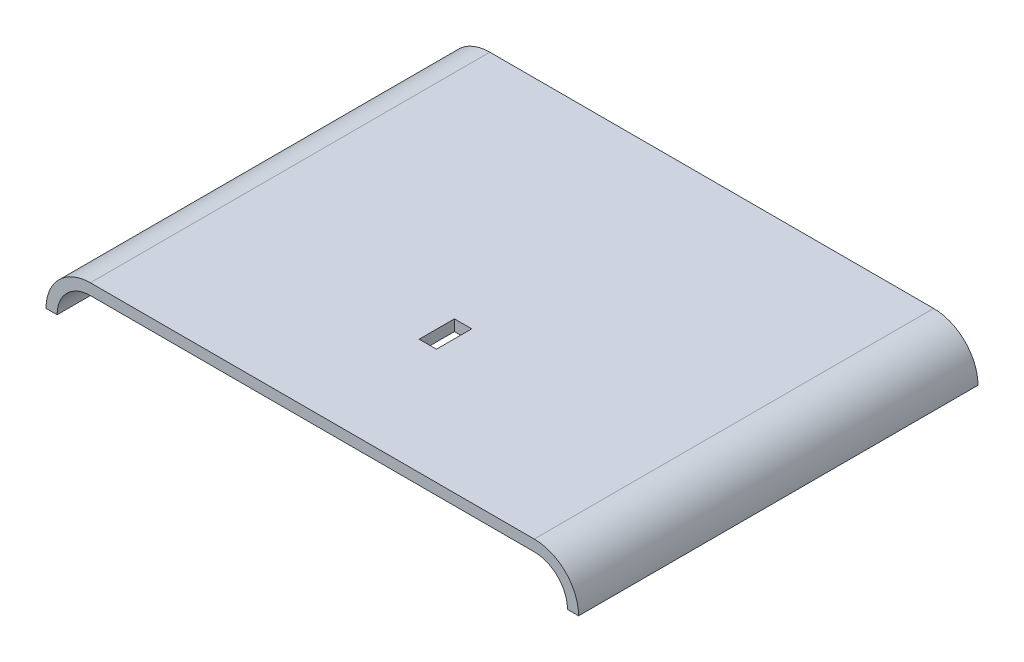
ISO-10303-21;
HEADER;
FILE_DESCRIPTION(('STEP AP214'),'2;1');
FILE_NAME('part.step','',(''),(''),'','','');
FILE_SCHEMA(('AUTOMOTIVE_DESIGN { 1 0 10303 214 1 1 1 1 }'));
ENDSEC;
DATA;
#1=APPLICATION_CONTEXT('core data for automotive mechanical design processes');
#2=APPLICATION_PROTOCOL_DEFINITION('international standard','automotive_design',2000,#1);
#3=PRODUCT_CONTEXT('',#1,'mechanical');
#4=PRODUCT('Part','Part','',(#3));
#5=PRODUCT_RELATED_PRODUCT_CATEGORY('part','',(#4));
#6=PRODUCT_DEFINITION_FORMATION('','',#4);
#7=PRODUCT_DEFINITION_CONTEXT('part definition',#1,'design');
#8=PRODUCT_DEFINITION('design','',#6,#7);
#9=PRODUCT_DEFINITION_SHAPE('','',#8);
#10=(LENGTH_UNIT() NAMED_UNIT(*) SI_UNIT(.MILLI.,.METRE.));
#11=(NAMED_UNIT(*) PLANE_ANGLE_UNIT() SI_UNIT($,.RADIAN.));
#12=(NAMED_UNIT(*) SI_UNIT($,.STERADIAN.) SOLID_ANGLE_UNIT());
#13=UNCERTAINTY_MEASURE_WITH_UNIT(LENGTH_MEASURE(1.E-05),#10,'distance_accuracy_value','');
#14=(GEOMETRIC_REPRESENTATION_CONTEXT(3) GLOBAL_UNCERTAINTY_ASSIGNED_CONTEXT((#13)) GLOBAL_UNIT_ASSIGNED_CONTEXT((#10,
#11,#12)) REPRESENTATION_CONTEXT('',''));
#15=CARTESIAN_POINT('',(0.,0.,0.));
#16=DIRECTION('',(0.,0.,1.));
#17=DIRECTION('',(1.,0.,0.));
#18=AXIS2_PLACEMENT_3D('',#15,#16,#17);
#19=CARTESIAN_POINT('',(254.,-50.8,457.2));
#20=DIRECTION('',(0.,0.,-1.));
#21=DIRECTION('',(-1.,0.,0.));
#22=AXIS2_PLACEMENT_3D('',#19,#20,#21);
#23=CYLINDRICAL_SURFACE('',#22,38.1);
#24=CARTESIAN_POINT('',(254.,-50.8,0.));
#25=DIRECTION('',(0.,0.,1.));
#26=DIRECTION('',(1.,0.,0.));
#27=AXIS2_PLACEMENT_3D('',#24,#25,#26);
#28=CIRCLE('',#27,38.1);
#29=CARTESIAN_POINT('',(254.,-12.7,0.));
#30=VERTEX_POINT('',#29);
#31=CARTESIAN_POINT('',(292.1,-50.8,0.));
#32=VERTEX_POINT('',#31);
#33=EDGE_CURVE('E194',#30,#32,#28,.F.);
#34=ORIENTED_EDGE('',*,*,#33,.T.);
#35=DIRECTION('',(0.,0.,-1.));
#36=VECTOR('',#35,1.);
#37=CARTESIAN_POINT('',(292.1,-50.8,457.2));
#38=LINE('',#37,#36);
#39=CARTESIAN_POINT('',(292.1,-50.8,457.2));
#40=VERTEX_POINT('',#39);
#41=EDGE_CURVE('E228',#40,#32,#38,.T.);
#42=ORIENTED_EDGE('',*,*,#41,.F.);
#43=CARTESIAN_POINT('',(254.,-50.8,457.2));
#44=DIRECTION('',(0.,0.,1.));
#45=DIRECTION('',(1.,0.,0.));
#46=AXIS2_PLACEMENT_3D('',#43,#44,#45);
#47=CIRCLE('',#46,38.1);
#48=CARTESIAN_POINT('',(254.,-12.7,457.2));
#49=VERTEX_POINT('',#48);
#50=EDGE_CURVE('E195',#49,#40,#47,.F.);
#51=ORIENTED_EDGE('',*,*,#50,.F.);
#52=DIRECTION('',(0.,0.,-1.));
#53=VECTOR('',#52,1.);
#54=CARTESIAN_POINT('',(254.,-12.7,457.2));
#55=LINE('',#54,#53);
#56=EDGE_CURVE('E209',#49,#30,#55,.T.);
#57=ORIENTED_EDGE('',*,*,#56,.T.);
#58=EDGE_LOOP('',(#34,#42,#51,#57));
#59=FACE_BOUND('',#58,.T.);
#60=ADVANCED_FACE('F43',(#59),#23,.F.);
#61=CARTESIAN_POINT('',(304.8,-50.8,457.2));
#62=DIRECTION('',(0.,-1.,0.));
#63=DIRECTION('',(0.,0.,-1.));
#64=AXIS2_PLACEMENT_3D('',#61,#62,#63);
#65=PLANE('',#64);
#66=DIRECTION('',(-1.,0.,0.));
#67=VECTOR('',#66,1.);
#68=CARTESIAN_POINT('',(304.8,-50.8,0.));
#69=LINE('',#68,#67);
#70=CARTESIAN_POINT('',(304.8,-50.8,0.));
#71=VERTEX_POINT('',#70);
#72=EDGE_CURVE('E212',#71,#32,#69,.T.);
#73=ORIENTED_EDGE('',*,*,#72,.F.);
#74=DIRECTION('',(0.,0.,-1.));
#75=VECTOR('',#74,1.);
#76=CARTESIAN_POINT('',(304.8,-50.8,457.2));
#77=LINE('',#76,#75);
#78=CARTESIAN_POINT('',(304.8,-50.8,457.2));
#79=VERTEX_POINT('',#78);
#80=EDGE_CURVE('E226',#79,#71,#77,.T.);
#81=ORIENTED_EDGE('',*,*,#80,.F.);
#82=DIRECTION('',(-1.,0.,0.));
#83=VECTOR('',#82,1.);
#84=CARTESIAN_POINT('',(304.8,-50.8,457.2));
#85=LINE('',#84,#83);
#86=EDGE_CURVE('E197',#79,#40,#85,.T.);
#87=ORIENTED_EDGE('',*,*,#86,.T.);
#88=ORIENTED_EDGE('',*,*,#41,.T.);
#89=EDGE_LOOP('',(#73,#81,#87,#88));
#90=FACE_BOUND('',#89,.T.);
#91=ADVANCED_FACE('F255',(#90),#65,.T.);
#92=CARTESIAN_POINT('',(254.,-50.8,457.2));
#93=DIRECTION('',(0.,0.,-1.));
#94=DIRECTION('',(-1.,0.,0.));
#95=AXIS2_PLACEMENT_3D('',#92,#93,#94);
#96=CYLINDRICAL_SURFACE('',#95,50.8);
#97=CARTESIAN_POINT('',(254.,-50.8,0.));
#98=DIRECTION('',(0.,0.,-1.));
#99=DIRECTION('',(-1.,0.,0.));
#100=AXIS2_PLACEMENT_3D('',#97,#98,#99);
#101=CIRCLE('',#100,50.8);
#102=CARTESIAN_POINT('',(254.,0.,0.));
#103=VERTEX_POINT('',#102);
#104=EDGE_CURVE('E215',#103,#71,#101,.T.);
#105=ORIENTED_EDGE('',*,*,#104,.F.);
#106=DIRECTION('',(0.,0.,-1.));
#107=VECTOR('',#106,1.);
#108=CARTESIAN_POINT('',(254.,0.,457.2));
#109=LINE('',#108,#107);
#110=CARTESIAN_POINT('',(254.,0.,457.2));
#111=VERTEX_POINT('',#110);
#112=EDGE_CURVE('E224',#111,#103,#109,.T.);
#113=ORIENTED_EDGE('',*,*,#112,.F.);
#114=CARTESIAN_POINT('',(254.,-50.8,457.2));
#115=DIRECTION('',(0.,0.,-1.));
#116=DIRECTION('',(-1.,0.,0.));
#117=AXIS2_PLACEMENT_3D('',#114,#115,#116);
#118=CIRCLE('',#117,50.8);
#119=EDGE_CURVE('E201',#111,#79,#118,.T.);
#120=ORIENTED_EDGE('',*,*,#119,.T.);
#121=ORIENTED_EDGE('',*,*,#80,.T.);
#122=EDGE_LOOP('',(#105,#113,#120,#121));
#123=FACE_BOUND('',#122,.T.);
#124=ADVANCED_FACE('F260',(#123),#96,.T.);
#125=CARTESIAN_POINT('',(0.,0.,457.2));
#126=DIRECTION('',(0.,1.,0.));
#127=DIRECTION('',(0.,0.,1.));
#128=AXIS2_PLACEMENT_3D('',#125,#126,#127);
#129=PLANE('',#128);
#130=DIRECTION('',(0.,0.,1.));
#131=VECTOR('',#130,1.);
#132=CARTESIAN_POINT('',(-9.90599999999999,0.,284.607));
#133=LINE('',#132,#131);
#134=CARTESIAN_POINT('',(-9.90599999999999,0.,284.607));
#135=VERTEX_POINT('',#134);
#136=CARTESIAN_POINT('',(-9.90599999999999,0.,324.993));
#137=VERTEX_POINT('',#136);
#138=EDGE_CURVE('E60',#135,#137,#133,.T.);
#139=ORIENTED_EDGE('',*,*,#138,.F.);
#140=DIRECTION('',(-1.,0.,0.));
#141=VECTOR('',#140,1.);
#142=CARTESIAN_POINT('',(9.90600000000001,0.,284.607));
#143=LINE('',#142,#141);
#144=CARTESIAN_POINT('',(9.90600000000001,0.,284.607));
#145=VERTEX_POINT('',#144);
#146=EDGE_CURVE('E157',#145,#135,#143,.T.);
#147=ORIENTED_EDGE('',*,*,#146,.F.);
#148=DIRECTION('',(0.,0.,-1.));
#149=VECTOR('',#148,1.);
#150=CARTESIAN_POINT('',(9.90600000000001,0.,284.607));
#151=LINE('',#150,#149);
#152=CARTESIAN_POINT('',(9.90600000000001,0.,324.993));
#153=VERTEX_POINT('',#152);
#154=EDGE_CURVE('E139',#153,#145,#151,.T.);
#155=ORIENTED_EDGE('',*,*,#154,.F.);
#156=DIRECTION('',(1.,0.,0.));
#157=VECTOR('',#156,1.);
#158=CARTESIAN_POINT('',(9.90600000000001,0.,324.993));
#159=LINE('',#158,#157);
#160=EDGE_CURVE('E149',#137,#153,#159,.T.);
#161=ORIENTED_EDGE('',*,*,#160,.F.);
#162=EDGE_LOOP('',(#139,#147,#155,#161));
#163=FACE_BOUND('',#162,.T.);
#164=DIRECTION('',(1.,0.,0.));
#165=VECTOR('',#164,1.);
#166=CARTESIAN_POINT('',(0.,0.,0.));
#167=LINE('',#166,#165);
#168=CARTESIAN_POINT('',(-254.,0.,0.));
#169=VERTEX_POINT('',#168);
#170=EDGE_CURVE('E218',#169,#103,#167,.T.);
#171=ORIENTED_EDGE('',*,*,#170,.F.);
#172=DIRECTION('',(0.,0.,-1.));
#173=VECTOR('',#172,1.);
#174=CARTESIAN_POINT('',(-254.,0.,457.2));
#175=LINE('',#174,#173);
#176=CARTESIAN_POINT('',(-254.,0.,457.2));
#177=VERTEX_POINT('',#176);
#178=EDGE_CURVE('E188',#177,#169,#175,.T.);
#179=ORIENTED_EDGE('',*,*,#178,.F.);
#180=DIRECTION('',(1.,0.,0.));
#181=VECTOR('',#180,1.);
#182=CARTESIAN_POINT('',(0.,0.,457.2));
#183=LINE('',#182,#181);
#184=EDGE_CURVE('E204',#177,#111,#183,.T.);
#185=ORIENTED_EDGE('',*,*,#184,.T.);
#186=ORIENTED_EDGE('',*,*,#112,.T.);
#187=EDGE_LOOP('',(#171,#179,#185,#186));
#188=FACE_BOUND('',#187,.T.);
#189=ADVANCED_FACE('F154',(#163,#188),#129,.T.);
#190=CARTESIAN_POINT('',(0.,-12.7,457.2));
#191=DIRECTION('',(0.,1.,0.));
#192=DIRECTION('',(0.,0.,1.));
#193=AXIS2_PLACEMENT_3D('',#190,#191,#192);
#194=PLANE('',#193);
#195=DIRECTION('',(-1.,0.,0.));
#196=VECTOR('',#195,1.);
#197=CARTESIAN_POINT('',(0.,-12.7,284.607));
#198=LINE('',#197,#196);
#199=CARTESIAN_POINT('',(9.90600000000001,-12.7,284.607));
#200=VERTEX_POINT('',#199);
#201=CARTESIAN_POINT('',(-9.90599999999999,-12.7,284.607));
#202=VERTEX_POINT('',#201);
#203=EDGE_CURVE('E51',#200,#202,#198,.T.);
#204=ORIENTED_EDGE('',*,*,#203,.T.);
#205=DIRECTION('',(0.,0.,1.));
#206=VECTOR('',#205,1.);
#207=CARTESIAN_POINT('',(-9.90599999999997,-12.7,457.2));
#208=LINE('',#207,#206);
#209=CARTESIAN_POINT('',(-9.90599999999999,-12.7,324.993));
#210=VERTEX_POINT('',#209);
#211=EDGE_CURVE('E11',#202,#210,#208,.T.);
#212=ORIENTED_EDGE('',*,*,#211,.T.);
#213=DIRECTION('',(1.,0.,0.));
#214=VECTOR('',#213,1.);
#215=CARTESIAN_POINT('',(0.,-12.7,324.993));
#216=LINE('',#215,#214);
#217=CARTESIAN_POINT('',(9.90600000000001,-12.7,324.993));
#218=VERTEX_POINT('',#217);
#219=EDGE_CURVE('E230',#210,#218,#216,.T.);
#220=ORIENTED_EDGE('',*,*,#219,.T.);
#221=DIRECTION('',(0.,0.,-1.));
#222=VECTOR('',#221,1.);
#223=CARTESIAN_POINT('',(9.90600000000003,-12.7,457.2));
#224=LINE('',#223,#222);
#225=EDGE_CURVE('E142',#218,#200,#224,.T.);
#226=ORIENTED_EDGE('',*,*,#225,.T.);
#227=EDGE_LOOP('',(#204,#212,#220,#226));
#228=FACE_BOUND('',#227,.T.);
#229=DIRECTION('',(1.,0.,0.));
#230=VECTOR('',#229,1.);
#231=CARTESIAN_POINT('',(0.,-12.7,0.));
#232=LINE('',#231,#230);
#233=CARTESIAN_POINT('',(-254.,-12.7,0.));
#234=VERTEX_POINT('',#233);
#235=EDGE_CURVE('E198',#234,#30,#232,.T.);
#236=ORIENTED_EDGE('',*,*,#235,.T.);
#237=ORIENTED_EDGE('',*,*,#56,.F.);
#238=DIRECTION('',(1.,0.,0.));
#239=VECTOR('',#238,1.);
#240=CARTESIAN_POINT('',(0.,-12.7,457.2));
#241=LINE('',#240,#239);
#242=CARTESIAN_POINT('',(-254.,-12.7,457.2));
#243=VERTEX_POINT('',#242);
#244=EDGE_CURVE('E207',#243,#49,#241,.T.);
#245=ORIENTED_EDGE('',*,*,#244,.F.);
#246=DIRECTION('',(0.,0.,-1.));
#247=VECTOR('',#246,1.);
#248=CARTESIAN_POINT('',(-254.,-12.7,457.2));
#249=LINE('',#248,#247);
#250=EDGE_CURVE('E191',#243,#234,#249,.T.);
#251=ORIENTED_EDGE('',*,*,#250,.T.);
#252=EDGE_LOOP('',(#236,#237,#245,#251));
#253=FACE_BOUND('',#252,.T.);
#254=ADVANCED_FACE('F236',(#228,#253),#194,.F.);
#255=CARTESIAN_POINT('',(254.,-50.8,457.2));
#256=DIRECTION('',(0.,0.,1.));
#257=DIRECTION('',(1.,0.,0.));
#258=AXIS2_PLACEMENT_3D('',#255,#256,#257);
#259=PLANE('',#258);
#260=ORIENTED_EDGE('',*,*,#50,.T.);
#261=ORIENTED_EDGE('',*,*,#86,.F.);
#262=ORIENTED_EDGE('',*,*,#119,.F.);
#263=ORIENTED_EDGE('',*,*,#184,.F.);
#264=CARTESIAN_POINT('',(-254.,-50.8,457.2));
#265=DIRECTION('',(0.,0.,1.));
#266=DIRECTION('',(1.,0.,0.));
#267=AXIS2_PLACEMENT_3D('',#264,#265,#266);
#268=CIRCLE('',#267,50.8);
#269=CARTESIAN_POINT('',(-304.8,-50.8,457.2));
#270=VERTEX_POINT('',#269);
#271=EDGE_CURVE('E172',#177,#270,#268,.T.);
#272=ORIENTED_EDGE('',*,*,#271,.T.);
#273=DIRECTION('',(1.,0.,0.));
#274=VECTOR('',#273,1.);
#275=CARTESIAN_POINT('',(-304.8,-50.8,457.2));
#276=LINE('',#275,#274);
#277=CARTESIAN_POINT('',(-292.1,-50.8,457.2));
#278=VERTEX_POINT('',#277);
#279=EDGE_CURVE('E175',#270,#278,#276,.T.);
#280=ORIENTED_EDGE('',*,*,#279,.T.);
#281=CARTESIAN_POINT('',(-254.,-50.8,457.2));
#282=DIRECTION('',(0.,0.,-1.));
#283=DIRECTION('',(-1.,0.,0.));
#284=AXIS2_PLACEMENT_3D('',#281,#282,#283);
#285=CIRCLE('',#284,38.1);
#286=EDGE_CURVE('E169',#243,#278,#285,.F.);
#287=ORIENTED_EDGE('',*,*,#286,.F.);
#288=ORIENTED_EDGE('',*,*,#244,.T.);
#289=EDGE_LOOP('',(#260,#261,#262,#263,#272,#280,#287,#288));
#290=FACE_BOUND('',#289,.T.);
#291=ADVANCED_FACE('F273',(#290),#259,.T.);
#292=CARTESIAN_POINT('',(254.,-50.8,0.));
#293=DIRECTION('',(0.,0.,1.));
#294=DIRECTION('',(1.,0.,0.));
#295=AXIS2_PLACEMENT_3D('',#292,#293,#294);
#296=PLANE('',#295);
#297=ORIENTED_EDGE('',*,*,#33,.F.);
#298=ORIENTED_EDGE('',*,*,#235,.F.);
#299=CARTESIAN_POINT('',(-254.,-50.8,0.));
#300=DIRECTION('',(0.,0.,-1.));
#301=DIRECTION('',(-1.,0.,0.));
#302=AXIS2_PLACEMENT_3D('',#299,#300,#301);
#303=CIRCLE('',#302,38.1);
#304=CARTESIAN_POINT('',(-292.1,-50.8,0.));
#305=VERTEX_POINT('',#304);
#306=EDGE_CURVE('E165',#234,#305,#303,.F.);
#307=ORIENTED_EDGE('',*,*,#306,.T.);
#308=DIRECTION('',(1.,0.,0.));
#309=VECTOR('',#308,1.);
#310=CARTESIAN_POINT('',(-304.8,-50.8,0.));
#311=LINE('',#310,#309);
#312=CARTESIAN_POINT('',(-304.8,-50.8,0.));
#313=VERTEX_POINT('',#312);
#314=EDGE_CURVE('E173',#313,#305,#311,.T.);
#315=ORIENTED_EDGE('',*,*,#314,.F.);
#316=CARTESIAN_POINT('',(-254.,-50.8,0.));
#317=DIRECTION('',(0.,0.,1.));
#318=DIRECTION('',(1.,0.,0.));
#319=AXIS2_PLACEMENT_3D('',#316,#317,#318);
#320=CIRCLE('',#319,50.8);
#321=EDGE_CURVE('E180',#169,#313,#320,.T.);
#322=ORIENTED_EDGE('',*,*,#321,.F.);
#323=ORIENTED_EDGE('',*,*,#170,.T.);
#324=ORIENTED_EDGE('',*,*,#104,.T.);
#325=ORIENTED_EDGE('',*,*,#72,.T.);
#326=EDGE_LOOP('',(#297,#298,#307,#315,#322,#323,#324,#325));
#327=FACE_BOUND('',#326,.T.);
#328=ADVANCED_FACE('F268',(#327),#296,.F.);
#329=CARTESIAN_POINT('',(-254.,-50.8,457.2));
#330=DIRECTION('',(0.,0.,-1.));
#331=DIRECTION('',(-1.,0.,0.));
#332=AXIS2_PLACEMENT_3D('',#329,#330,#331);
#333=CYLINDRICAL_SURFACE('',#332,38.1);
#334=ORIENTED_EDGE('',*,*,#306,.F.);
#335=ORIENTED_EDGE('',*,*,#250,.F.);
#336=ORIENTED_EDGE('',*,*,#286,.T.);
#337=DIRECTION('',(0.,0.,-1.));
#338=VECTOR('',#337,1.);
#339=CARTESIAN_POINT('',(-292.1,-50.8,457.2));
#340=LINE('',#339,#338);
#341=EDGE_CURVE('E177',#278,#305,#340,.T.);
#342=ORIENTED_EDGE('',*,*,#341,.T.);
#343=EDGE_LOOP('',(#334,#335,#336,#342));
#344=FACE_BOUND('',#343,.T.);
#345=ADVANCED_FACE('F287',(#344),#333,.F.);
#346=CARTESIAN_POINT('',(-254.,-50.8,457.2));
#347=DIRECTION('',(0.,0.,-1.));
#348=DIRECTION('',(-1.,0.,0.));
#349=AXIS2_PLACEMENT_3D('',#346,#347,#348);
#350=CYLINDRICAL_SURFACE('',#349,50.8);
#351=ORIENTED_EDGE('',*,*,#321,.T.);
#352=DIRECTION('',(0.,0.,-1.));
#353=VECTOR('',#352,1.);
#354=CARTESIAN_POINT('',(-304.8,-50.8,457.2));
#355=LINE('',#354,#353);
#356=EDGE_CURVE('E185',#270,#313,#355,.T.);
#357=ORIENTED_EDGE('',*,*,#356,.F.);
#358=ORIENTED_EDGE('',*,*,#271,.F.);
#359=ORIENTED_EDGE('',*,*,#178,.T.);
#360=EDGE_LOOP('',(#351,#357,#358,#359));
#361=FACE_BOUND('',#360,.T.);
#362=ADVANCED_FACE('F250',(#361),#350,.T.);
#363=CARTESIAN_POINT('',(-304.8,-50.8,457.2));
#364=DIRECTION('',(0.,1.,0.));
#365=DIRECTION('',(0.,0.,1.));
#366=AXIS2_PLACEMENT_3D('',#363,#364,#365);
#367=PLANE('',#366);
#368=ORIENTED_EDGE('',*,*,#314,.T.);
#369=ORIENTED_EDGE('',*,*,#341,.F.);
#370=ORIENTED_EDGE('',*,*,#279,.F.);
#371=ORIENTED_EDGE('',*,*,#356,.T.);
#372=EDGE_LOOP('',(#368,#369,#370,#371));
#373=FACE_BOUND('',#372,.T.);
#374=ADVANCED_FACE('F243',(#373),#367,.F.);
#375=CARTESIAN_POINT('',(-9.90599999999999,-50.8,284.607));
#376=DIRECTION('',(-1.,0.,0.));
#377=DIRECTION('',(0.,0.,1.));
#378=AXIS2_PLACEMENT_3D('',#375,#376,#377);
#379=PLANE('',#378);
#380=DIRECTION('',(0.,1.,0.));
#381=VECTOR('',#380,1.);
#382=CARTESIAN_POINT('',(-9.90599999999999,-50.8,284.607));
#383=LINE('',#382,#381);
#384=EDGE_CURVE('E163',#202,#135,#383,.T.);
#385=ORIENTED_EDGE('',*,*,#384,.T.);
#386=ORIENTED_EDGE('',*,*,#138,.T.);
#387=DIRECTION('',(0.,1.,0.));
#388=VECTOR('',#387,1.);
#389=CARTESIAN_POINT('',(-9.90599999999999,-50.8,324.993));
#390=LINE('',#389,#388);
#391=EDGE_CURVE('E146',#210,#137,#390,.T.);
#392=ORIENTED_EDGE('',*,*,#391,.F.);
#393=ORIENTED_EDGE('',*,*,#211,.F.);
#394=EDGE_LOOP('',(#385,#386,#392,#393));
#395=FACE_BOUND('',#394,.T.);
#396=ADVANCED_FACE('F241',(#395),#379,.F.);
#397=CARTESIAN_POINT('',(9.90600000000001,-50.8,284.607));
#398=DIRECTION('',(0.,0.,-1.));
#399=DIRECTION('',(-1.,0.,0.));
#400=AXIS2_PLACEMENT_3D('',#397,#398,#399);
#401=PLANE('',#400);
#402=DIRECTION('',(0.,1.,0.));
#403=VECTOR('',#402,1.);
#404=CARTESIAN_POINT('',(9.90600000000001,-50.8,284.607));
#405=LINE('',#404,#403);
#406=EDGE_CURVE('E145',#200,#145,#405,.T.);
#407=ORIENTED_EDGE('',*,*,#406,.T.);
#408=ORIENTED_EDGE('',*,*,#146,.T.);
#409=ORIENTED_EDGE('',*,*,#384,.F.);
#410=ORIENTED_EDGE('',*,*,#203,.F.);
#411=EDGE_LOOP('',(#407,#408,#409,#410));
#412=FACE_BOUND('',#411,.T.);
#413=ADVANCED_FACE('F240',(#412),#401,.F.);
#414=CARTESIAN_POINT('',(9.90600000000001,-50.8,284.607));
#415=DIRECTION('',(1.,0.,0.));
#416=DIRECTION('',(0.,0.,-1.));
#417=AXIS2_PLACEMENT_3D('',#414,#415,#416);
#418=PLANE('',#417);
#419=DIRECTION('',(0.,1.,0.));
#420=VECTOR('',#419,1.);
#421=CARTESIAN_POINT('',(9.90600000000001,-50.8,324.993));
#422=LINE('',#421,#420);
#423=EDGE_CURVE('E70',#218,#153,#422,.T.);
#424=ORIENTED_EDGE('',*,*,#423,.T.);
#425=ORIENTED_EDGE('',*,*,#154,.T.);
#426=ORIENTED_EDGE('',*,*,#406,.F.);
#427=ORIENTED_EDGE('',*,*,#225,.F.);
#428=EDGE_LOOP('',(#424,#425,#426,#427));
#429=FACE_BOUND('',#428,.T.);
#430=ADVANCED_FACE('F136',(#429),#418,.F.);
#431=CARTESIAN_POINT('',(9.90600000000001,-50.8,324.993));
#432=DIRECTION('',(0.,0.,1.));
#433=DIRECTION('',(1.,0.,0.));
#434=AXIS2_PLACEMENT_3D('',#431,#432,#433);
#435=PLANE('',#434);
#436=ORIENTED_EDGE('',*,*,#391,.T.);
#437=ORIENTED_EDGE('',*,*,#160,.T.);
#438=ORIENTED_EDGE('',*,*,#423,.F.);
#439=ORIENTED_EDGE('',*,*,#219,.F.);
#440=EDGE_LOOP('',(#436,#437,#438,#439));
#441=FACE_BOUND('',#440,.T.);
#442=ADVANCED_FACE('F150',(#441),#435,.F.);
#443=CLOSED_SHELL('',(#60,#91,#124,#189,#254,#291,#328,#345,#362,#374,#396,#413,#430,#442));
#444=MANIFOLD_SOLID_BREP('B2',#443);
#445=ADVANCED_BREP_SHAPE_REPRESENTATION('',(#18,#444),#14);
#446=SHAPE_DEFINITION_REPRESENTATION(#9,#445);
ENDSEC;
END-ISO-10303-21;
